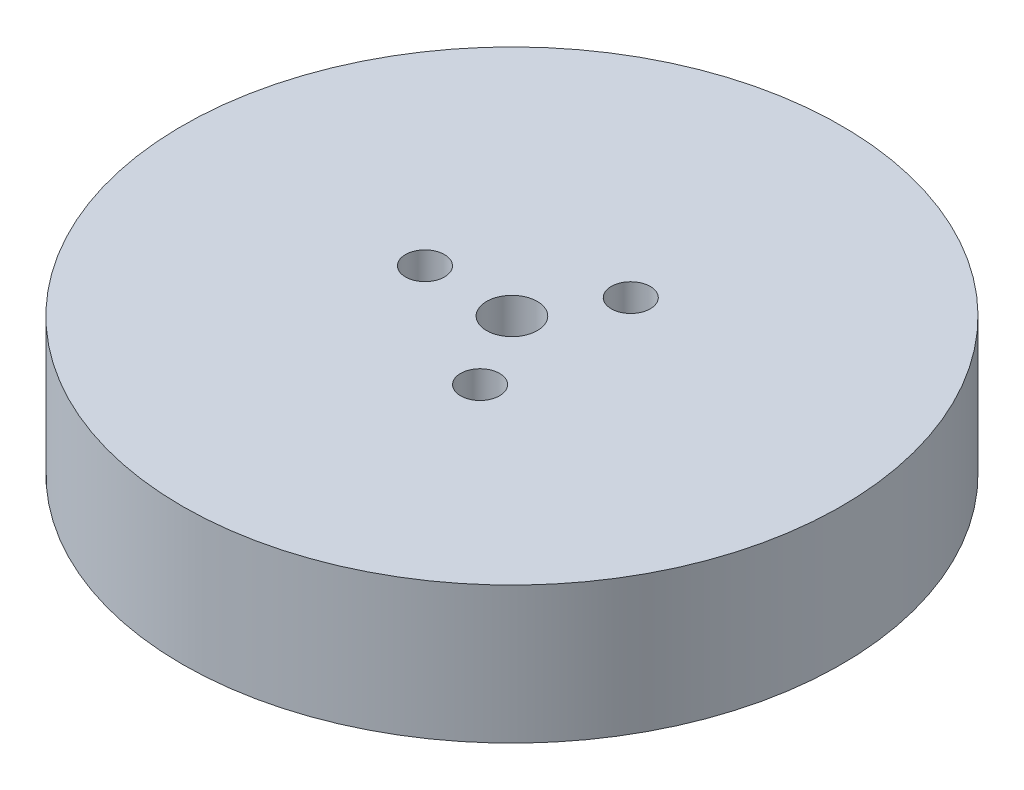
ISO-10303-21;
HEADER;
FILE_DESCRIPTION(('STEP AP214'),'2;1');
FILE_NAME('part.step','',(''),(''),'','','');
FILE_SCHEMA(('AUTOMOTIVE_DESIGN { 1 0 10303 214 1 1 1 1 }'));
ENDSEC;
DATA;
#1=APPLICATION_CONTEXT('core data for automotive mechanical design processes');
#2=APPLICATION_PROTOCOL_DEFINITION('international standard','automotive_design',2000,#1);
#3=PRODUCT_CONTEXT('',#1,'mechanical');
#4=PRODUCT('Part','Part','',(#3));
#5=PRODUCT_RELATED_PRODUCT_CATEGORY('part','',(#4));
#6=PRODUCT_DEFINITION_FORMATION('','',#4);
#7=PRODUCT_DEFINITION_CONTEXT('part definition',#1,'design');
#8=PRODUCT_DEFINITION('design','',#6,#7);
#9=PRODUCT_DEFINITION_SHAPE('','',#8);
#10=(LENGTH_UNIT() NAMED_UNIT(*) SI_UNIT(.MILLI.,.METRE.));
#11=(NAMED_UNIT(*) PLANE_ANGLE_UNIT() SI_UNIT($,.RADIAN.));
#12=(NAMED_UNIT(*) SI_UNIT($,.STERADIAN.) SOLID_ANGLE_UNIT());
#13=UNCERTAINTY_MEASURE_WITH_UNIT(LENGTH_MEASURE(1.E-05),#10,'distance_accuracy_value','');
#14=(GEOMETRIC_REPRESENTATION_CONTEXT(3) GLOBAL_UNCERTAINTY_ASSIGNED_CONTEXT((#13)) GLOBAL_UNIT_ASSIGNED_CONTEXT((#10,
#11,#12)) REPRESENTATION_CONTEXT('',''));
#15=CARTESIAN_POINT('',(0.,0.,0.));
#16=DIRECTION('',(0.,0.,1.));
#17=DIRECTION('',(1.,0.,0.));
#18=AXIS2_PLACEMENT_3D('',#15,#16,#17);
#19=CARTESIAN_POINT('',(0.,27.,0.));
#20=DIRECTION('',(0.,-1.,0.));
#21=DIRECTION('',(0.,0.,-1.));
#22=AXIS2_PLACEMENT_3D('',#19,#20,#21);
#23=CYLINDRICAL_SURFACE('',#22,65.);
#24=CARTESIAN_POINT('',(0.,27.,0.));
#25=DIRECTION('',(0.,1.,0.));
#26=DIRECTION('',(0.,0.,1.));
#27=AXIS2_PLACEMENT_3D('',#24,#25,#26);
#28=CIRCLE('',#27,65.);
#29=CARTESIAN_POINT('',(0.,27.,65.));
#30=VERTEX_POINT('',#29);
#31=EDGE_CURVE('E10',#30,#30,#28,.T.);
#32=ORIENTED_EDGE('',*,*,#31,.F.);
#33=EDGE_LOOP('',(#32));
#34=FACE_BOUND('',#33,.T.);
#35=CARTESIAN_POINT('',(0.,0.,0.));
#36=DIRECTION('',(0.,1.,0.));
#37=DIRECTION('',(0.,0.,1.));
#38=AXIS2_PLACEMENT_3D('',#35,#36,#37);
#39=CIRCLE('',#38,65.);
#40=CARTESIAN_POINT('',(0.,0.,65.));
#41=VERTEX_POINT('',#40);
#42=EDGE_CURVE('E37',#41,#41,#39,.T.);
#43=ORIENTED_EDGE('',*,*,#42,.T.);
#44=EDGE_LOOP('',(#43));
#45=FACE_BOUND('',#44,.T.);
#46=ADVANCED_FACE('F40',(#34,#45),#23,.T.);
#47=CARTESIAN_POINT('',(0.,27.,0.));
#48=DIRECTION('',(0.,1.,0.));
#49=DIRECTION('',(0.,0.,1.));
#50=AXIS2_PLACEMENT_3D('',#47,#48,#49);
#51=PLANE('',#50);
#52=CARTESIAN_POINT('',(8.5783562065575,27.,14.8581487951813));
#53=DIRECTION('',(0.,1.,0.));
#54=DIRECTION('',(0.866025403784436,0.,-0.500000000000004));
#55=AXIS2_PLACEMENT_3D('',#52,#53,#54);
#56=CIRCLE('',#55,3.84182211982783);
#57=CARTESIAN_POINT('',(11.9054717591494,27.,12.9372377352673));
#58=VERTEX_POINT('',#57);
#59=EDGE_CURVE('E70',#58,#58,#56,.T.);
#60=ORIENTED_EDGE('',*,*,#59,.F.);
#61=EDGE_LOOP('',(#60));
#62=FACE_BOUND('',#61,.T.);
#63=CARTESIAN_POINT('',(8.57835620655729,27.,-14.8581487951814));
#64=DIRECTION('',(0.,1.,0.));
#65=DIRECTION('',(-0.866025403784443,0.,-0.499999999999992));
#66=AXIS2_PLACEMENT_3D('',#63,#64,#65);
#67=CIRCLE('',#66,3.84182211982783);
#68=CARTESIAN_POINT('',(5.25124065396539,27.,-16.7790598550953));
#69=VERTEX_POINT('',#68);
#70=EDGE_CURVE('E61',#69,#69,#67,.T.);
#71=ORIENTED_EDGE('',*,*,#70,.F.);
#72=EDGE_LOOP('',(#71));
#73=FACE_BOUND('',#72,.T.);
#74=CARTESIAN_POINT('',(-17.1567124131149,27.,0.));
#75=DIRECTION('',(0.,1.,0.));
#76=DIRECTION('',(0.,0.,1.));
#77=AXIS2_PLACEMENT_3D('',#74,#75,#76);
#78=CIRCLE('',#77,3.84182211982783);
#79=CARTESIAN_POINT('',(-17.1567124131149,27.,3.84182211982783));
#80=VERTEX_POINT('',#79);
#81=EDGE_CURVE('E54',#80,#80,#78,.T.);
#82=ORIENTED_EDGE('',*,*,#81,.F.);
#83=EDGE_LOOP('',(#82));
#84=FACE_BOUND('',#83,.T.);
#85=CARTESIAN_POINT('',(0.,27.,0.));
#86=DIRECTION('',(0.,1.,0.));
#87=DIRECTION('',(0.,0.,1.));
#88=AXIS2_PLACEMENT_3D('',#85,#86,#87);
#89=CIRCLE('',#88,5.);
#90=CARTESIAN_POINT('',(0.,27.,5.));
#91=VERTEX_POINT('',#90);
#92=EDGE_CURVE('E50',#91,#91,#89,.T.);
#93=ORIENTED_EDGE('',*,*,#92,.F.);
#94=EDGE_LOOP('',(#93));
#95=FACE_BOUND('',#94,.T.);
#96=ORIENTED_EDGE('',*,*,#31,.T.);
#97=EDGE_LOOP('',(#96));
#98=FACE_BOUND('',#97,.T.);
#99=ADVANCED_FACE('F85',(#62,#73,#84,#95,#98),#51,.T.);
#100=CARTESIAN_POINT('',(0.,0.,0.));
#101=DIRECTION('',(0.,1.,0.));
#102=DIRECTION('',(0.,0.,1.));
#103=AXIS2_PLACEMENT_3D('',#100,#101,#102);
#104=PLANE('',#103);
#105=CARTESIAN_POINT('',(0.,0.,0.));
#106=DIRECTION('',(0.,1.,0.));
#107=DIRECTION('',(0.,0.,1.));
#108=AXIS2_PLACEMENT_3D('',#105,#106,#107);
#109=CIRCLE('',#108,5.);
#110=CARTESIAN_POINT('',(0.,0.,5.));
#111=VERTEX_POINT('',#110);
#112=EDGE_CURVE('E47',#111,#111,#109,.T.);
#113=ORIENTED_EDGE('',*,*,#112,.T.);
#114=EDGE_LOOP('',(#113));
#115=FACE_BOUND('',#114,.T.);
#116=ORIENTED_EDGE('',*,*,#42,.F.);
#117=EDGE_LOOP('',(#116));
#118=FACE_BOUND('',#117,.T.);
#119=ADVANCED_FACE('F84',(#115,#118),#104,.F.);
#120=CARTESIAN_POINT('',(0.,27.,0.));
#121=DIRECTION('',(0.,-1.,0.));
#122=DIRECTION('',(0.,0.,-1.));
#123=AXIS2_PLACEMENT_3D('',#120,#121,#122);
#124=CYLINDRICAL_SURFACE('',#123,5.);
#125=ORIENTED_EDGE('',*,*,#92,.T.);
#126=EDGE_LOOP('',(#125));
#127=FACE_BOUND('',#126,.T.);
#128=ORIENTED_EDGE('',*,*,#112,.F.);
#129=EDGE_LOOP('',(#128));
#130=FACE_BOUND('',#129,.T.);
#131=ADVANCED_FACE('F91',(#127,#130),#124,.F.);
#132=CARTESIAN_POINT('',(-17.1567124131149,5.43642242300995,0.));
#133=DIRECTION('',(0.,1.,0.));
#134=DIRECTION('',(0.,0.,1.));
#135=AXIS2_PLACEMENT_3D('',#132,#133,#134);
#136=CYLINDRICAL_SURFACE('',#135,3.84182211982783);
#137=CARTESIAN_POINT('',(-17.1567124131149,5.43642242300995,0.));
#138=DIRECTION('',(0.,1.,0.));
#139=DIRECTION('',(0.,0.,1.));
#140=AXIS2_PLACEMENT_3D('',#137,#138,#139);
#141=CIRCLE('',#140,3.84182211982783);
#142=CARTESIAN_POINT('',(-17.1567124131149,5.43642242300995,3.84182211982783));
#143=VERTEX_POINT('',#142);
#144=EDGE_CURVE('E55',#143,#143,#141,.T.);
#145=ORIENTED_EDGE('',*,*,#144,.F.);
#146=EDGE_LOOP('',(#145));
#147=FACE_BOUND('',#146,.T.);
#148=ORIENTED_EDGE('',*,*,#81,.T.);
#149=EDGE_LOOP('',(#148));
#150=FACE_BOUND('',#149,.T.);
#151=ADVANCED_FACE('F96',(#147,#150),#136,.F.);
#152=CARTESIAN_POINT('',(-17.1567124131149,5.43642242300995,0.));
#153=DIRECTION('',(0.,1.,0.));
#154=DIRECTION('',(0.,0.,1.));
#155=AXIS2_PLACEMENT_3D('',#152,#153,#154);
#156=PLANE('',#155);
#157=ORIENTED_EDGE('',*,*,#144,.T.);
#158=EDGE_LOOP('',(#157));
#159=FACE_BOUND('',#158,.T.);
#160=ADVANCED_FACE('F127',(#159),#156,.T.);
#161=CARTESIAN_POINT('',(8.57835620655729,5.43642242300995,-14.8581487951814));
#162=DIRECTION('',(0.,1.,0.));
#163=DIRECTION('',(0.,0.,1.));
#164=AXIS2_PLACEMENT_3D('',#161,#162,#163);
#165=CYLINDRICAL_SURFACE('',#164,3.84182211982783);
#166=CARTESIAN_POINT('',(8.57835620655729,5.43642242300995,-14.8581487951814));
#167=DIRECTION('',(0.,1.,0.));
#168=DIRECTION('',(-0.866025403784443,0.,-0.499999999999992));
#169=AXIS2_PLACEMENT_3D('',#166,#167,#168);
#170=CIRCLE('',#169,3.84182211982783);
#171=CARTESIAN_POINT('',(5.25124065396539,5.43642242300995,-16.7790598550953));
#172=VERTEX_POINT('',#171);
#173=EDGE_CURVE('E63',#172,#172,#170,.T.);
#174=ORIENTED_EDGE('',*,*,#173,.F.);
#175=EDGE_LOOP('',(#174));
#176=FACE_BOUND('',#175,.T.);
#177=ORIENTED_EDGE('',*,*,#70,.T.);
#178=EDGE_LOOP('',(#177));
#179=FACE_BOUND('',#178,.T.);
#180=ADVANCED_FACE('F133',(#176,#179),#165,.F.);
#181=CARTESIAN_POINT('',(8.57835620655729,5.43642242300995,-14.8581487951814));
#182=DIRECTION('',(0.,1.,0.));
#183=DIRECTION('',(-0.866025403784443,0.,-0.499999999999992));
#184=AXIS2_PLACEMENT_3D('',#181,#182,#183);
#185=PLANE('',#184);
#186=ORIENTED_EDGE('',*,*,#173,.T.);
#187=EDGE_LOOP('',(#186));
#188=FACE_BOUND('',#187,.T.);
#189=ADVANCED_FACE('F77',(#188),#185,.T.);
#190=CARTESIAN_POINT('',(8.5783562065575,5.43642242300995,14.8581487951813));
#191=DIRECTION('',(0.,1.,0.));
#192=DIRECTION('',(0.,0.,1.));
#193=AXIS2_PLACEMENT_3D('',#190,#191,#192);
#194=CYLINDRICAL_SURFACE('',#193,3.84182211982783);
#195=CARTESIAN_POINT('',(8.5783562065575,5.43642242300995,14.8581487951813));
#196=DIRECTION('',(0.,1.,0.));
#197=DIRECTION('',(0.866025403784436,0.,-0.500000000000004));
#198=AXIS2_PLACEMENT_3D('',#195,#196,#197);
#199=CIRCLE('',#198,3.84182211982783);
#200=CARTESIAN_POINT('',(11.9054717591494,5.43642242300995,12.9372377352673));
#201=VERTEX_POINT('',#200);
#202=EDGE_CURVE('E59',#201,#201,#199,.T.);
#203=ORIENTED_EDGE('',*,*,#202,.F.);
#204=EDGE_LOOP('',(#203));
#205=FACE_BOUND('',#204,.T.);
#206=ORIENTED_EDGE('',*,*,#59,.T.);
#207=EDGE_LOOP('',(#206));
#208=FACE_BOUND('',#207,.T.);
#209=ADVANCED_FACE('F73',(#205,#208),#194,.F.);
#210=CARTESIAN_POINT('',(8.5783562065575,5.43642242300995,14.8581487951813));
#211=DIRECTION('',(0.,1.,0.));
#212=DIRECTION('',(0.866025403784436,0.,-0.500000000000004));
#213=AXIS2_PLACEMENT_3D('',#210,#211,#212);
#214=PLANE('',#213);
#215=ORIENTED_EDGE('',*,*,#202,.T.);
#216=EDGE_LOOP('',(#215));
#217=FACE_BOUND('',#216,.T.);
#218=ADVANCED_FACE('F71',(#217),#214,.T.);
#219=CLOSED_SHELL('',(#46,#99,#119,#131,#151,#160,#180,#189,#209,#218));
#220=MANIFOLD_SOLID_BREP('B2',#219);
#221=ADVANCED_BREP_SHAPE_REPRESENTATION('',(#18,#220),#14);
#222=SHAPE_DEFINITION_REPRESENTATION(#9,#221);
ENDSEC;
END-ISO-10303-21;
